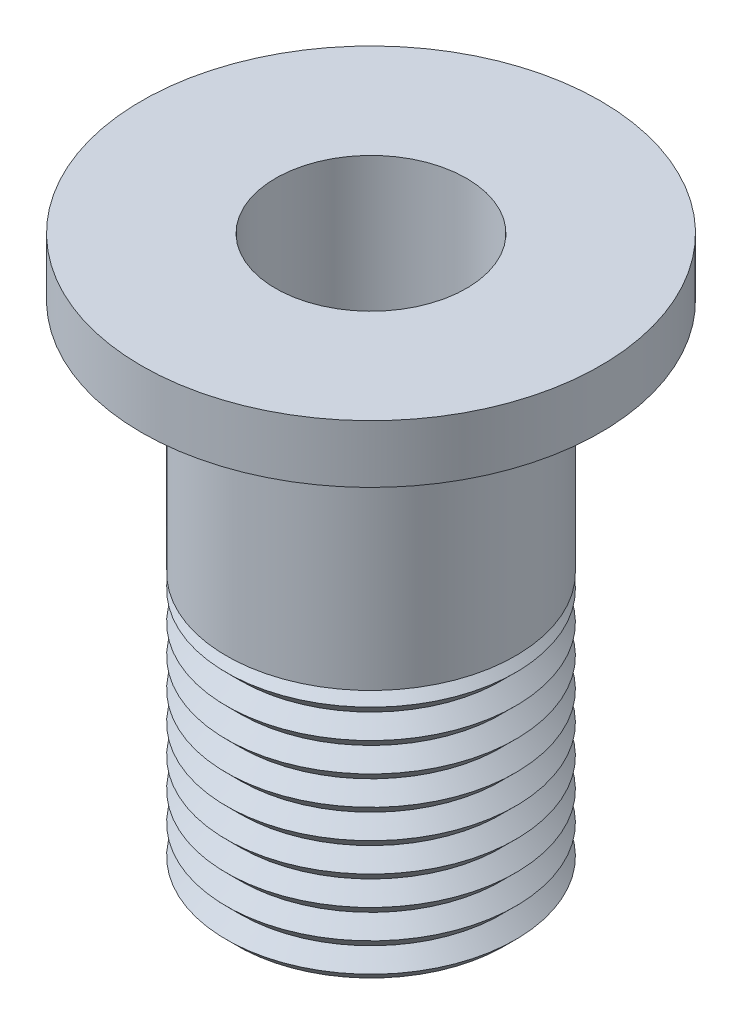
ISO-10303-21;
HEADER;
FILE_DESCRIPTION(('STEP AP214'),'2;1');
FILE_NAME('part.step','',(''),(''),'','','');
FILE_SCHEMA(('AUTOMOTIVE_DESIGN { 1 0 10303 214 1 1 1 1 }'));
ENDSEC;
DATA;
#1=APPLICATION_CONTEXT('core data for automotive mechanical design processes');
#2=APPLICATION_PROTOCOL_DEFINITION('international standard','automotive_design',2000,#1);
#3=PRODUCT_CONTEXT('',#1,'mechanical');
#4=PRODUCT('Part','Part','',(#3));
#5=PRODUCT_RELATED_PRODUCT_CATEGORY('part','',(#4));
#6=PRODUCT_DEFINITION_FORMATION('','',#4);
#7=PRODUCT_DEFINITION_CONTEXT('part definition',#1,'design');
#8=PRODUCT_DEFINITION('design','',#6,#7);
#9=PRODUCT_DEFINITION_SHAPE('','',#8);
#10=(LENGTH_UNIT() NAMED_UNIT(*) SI_UNIT(.MILLI.,.METRE.));
#11=(NAMED_UNIT(*) PLANE_ANGLE_UNIT() SI_UNIT($,.RADIAN.));
#12=(NAMED_UNIT(*) SI_UNIT($,.STERADIAN.) SOLID_ANGLE_UNIT());
#13=UNCERTAINTY_MEASURE_WITH_UNIT(LENGTH_MEASURE(1.E-05),#10,'distance_accuracy_value','');
#14=(GEOMETRIC_REPRESENTATION_CONTEXT(3) GLOBAL_UNCERTAINTY_ASSIGNED_CONTEXT((#13)) GLOBAL_UNIT_ASSIGNED_CONTEXT((#10,
#11,#12)) REPRESENTATION_CONTEXT('',''));
#15=CARTESIAN_POINT('',(0.,0.,0.));
#16=DIRECTION('',(0.,0.,1.));
#17=DIRECTION('',(1.,0.,0.));
#18=AXIS2_PLACEMENT_3D('',#15,#16,#17);
#19=CARTESIAN_POINT('',(4.61000000000001,0.,0.));
#20=DIRECTION('',(0.,-1.,0.));
#21=DIRECTION('',(0.,0.,-1.));
#22=AXIS2_PLACEMENT_3D('',#19,#20,#21);
#23=PLANE('',#22);
#24=CARTESIAN_POINT('',(0.,0.,0.));
#25=DIRECTION('',(0.,-1.,0.));
#26=DIRECTION('',(0.,0.,-1.));
#27=AXIS2_PLACEMENT_3D('',#24,#25,#26);
#28=CIRCLE('',#27,4.61000000000001);
#29=CARTESIAN_POINT('',(0.,0.,-4.61000000000001));
#30=VERTEX_POINT('',#29);
#31=EDGE_CURVE('E109',#30,#30,#28,.T.);
#32=ORIENTED_EDGE('',*,*,#31,.T.);
#33=EDGE_LOOP('',(#32));
#34=FACE_BOUND('',#33,.T.);
#35=CARTESIAN_POINT('',(0.,0.,0.));
#36=DIRECTION('',(0.,-1.,0.));
#37=DIRECTION('',(0.,0.,-1.));
#38=AXIS2_PLACEMENT_3D('',#35,#36,#37);
#39=CIRCLE('',#38,3.302);
#40=CARTESIAN_POINT('',(0.,0.,-3.302));
#41=VERTEX_POINT('',#40);
#42=EDGE_CURVE('E10',#41,#41,#39,.T.);
#43=ORIENTED_EDGE('',*,*,#42,.F.);
#44=EDGE_LOOP('',(#43));
#45=FACE_BOUND('',#44,.T.);
#46=ADVANCED_FACE('F30',(#34,#45),#23,.T.);
#47=CARTESIAN_POINT('',(0.,0.,0.));
#48=DIRECTION('',(0.,-1.,0.));
#49=DIRECTION('',(0.,0.,-1.));
#50=AXIS2_PLACEMENT_3D('',#47,#48,#49);
#51=CYLINDRICAL_SURFACE('',#50,3.302);
#52=ORIENTED_EDGE('',*,*,#42,.T.);
#53=EDGE_LOOP('',(#52));
#54=FACE_BOUND('',#53,.T.);
#55=CARTESIAN_POINT('',(0.,19.05,0.));
#56=DIRECTION('',(0.,-1.,0.));
#57=DIRECTION('',(0.,0.,-1.));
#58=AXIS2_PLACEMENT_3D('',#55,#56,#57);
#59=CIRCLE('',#58,3.302);
#60=CARTESIAN_POINT('',(0.,19.05,-3.302));
#61=VERTEX_POINT('',#60);
#62=EDGE_CURVE('E36',#61,#61,#59,.T.);
#63=ORIENTED_EDGE('',*,*,#62,.F.);
#64=EDGE_LOOP('',(#63));
#65=FACE_BOUND('',#64,.T.);
#66=ADVANCED_FACE('F127',(#54,#65),#51,.F.);
#67=CARTESIAN_POINT('',(3.302,19.05,0.));
#68=DIRECTION('',(0.,1.,0.));
#69=DIRECTION('',(0.,0.,1.));
#70=AXIS2_PLACEMENT_3D('',#67,#68,#69);
#71=PLANE('',#70);
#72=ORIENTED_EDGE('',*,*,#62,.T.);
#73=EDGE_LOOP('',(#72));
#74=FACE_BOUND('',#73,.T.);
#75=CARTESIAN_POINT('',(0.,19.05,0.));
#76=DIRECTION('',(0.,-1.,0.));
#77=DIRECTION('',(0.,0.,-1.));
#78=AXIS2_PLACEMENT_3D('',#75,#76,#77);
#79=CIRCLE('',#78,7.9375);
#80=CARTESIAN_POINT('',(0.,19.05,-7.9375));
#81=VERTEX_POINT('',#80);
#82=EDGE_CURVE('E40',#81,#81,#79,.T.);
#83=ORIENTED_EDGE('',*,*,#82,.F.);
#84=EDGE_LOOP('',(#83));
#85=FACE_BOUND('',#84,.T.);
#86=ADVANCED_FACE('F131',(#74,#85),#71,.T.);
#87=CARTESIAN_POINT('',(0.,0.,0.));
#88=DIRECTION('',(0.,-1.,0.));
#89=DIRECTION('',(0.,0.,-1.));
#90=AXIS2_PLACEMENT_3D('',#87,#88,#89);
#91=CYLINDRICAL_SURFACE('',#90,7.9375);
#92=ORIENTED_EDGE('',*,*,#82,.T.);
#93=EDGE_LOOP('',(#92));
#94=FACE_BOUND('',#93,.T.);
#95=CARTESIAN_POINT('',(0.,17.05,0.));
#96=DIRECTION('',(0.,-1.,0.));
#97=DIRECTION('',(0.,0.,-1.));
#98=AXIS2_PLACEMENT_3D('',#95,#96,#97);
#99=CIRCLE('',#98,7.9375);
#100=CARTESIAN_POINT('',(0.,17.05,-7.9375));
#101=VERTEX_POINT('',#100);
#102=EDGE_CURVE('E44',#101,#101,#99,.T.);
#103=ORIENTED_EDGE('',*,*,#102,.F.);
#104=EDGE_LOOP('',(#103));
#105=FACE_BOUND('',#104,.T.);
#106=ADVANCED_FACE('F135',(#94,#105),#91,.T.);
#107=CARTESIAN_POINT('',(7.9375,17.05,0.));
#108=DIRECTION('',(0.,-1.,0.));
#109=DIRECTION('',(0.,0.,-1.));
#110=AXIS2_PLACEMENT_3D('',#107,#108,#109);
#111=PLANE('',#110);
#112=ORIENTED_EDGE('',*,*,#102,.T.);
#113=EDGE_LOOP('',(#112));
#114=FACE_BOUND('',#113,.T.);
#115=CARTESIAN_POINT('',(0.,17.05,0.));
#116=DIRECTION('',(0.,-1.,0.));
#117=DIRECTION('',(0.,0.,-1.));
#118=AXIS2_PLACEMENT_3D('',#115,#116,#117);
#119=CIRCLE('',#118,5.);
#120=CARTESIAN_POINT('',(0.,17.05,-5.));
#121=VERTEX_POINT('',#120);
#122=EDGE_CURVE('E49',#121,#121,#119,.T.);
#123=ORIENTED_EDGE('',*,*,#122,.F.);
#124=EDGE_LOOP('',(#123));
#125=FACE_BOUND('',#124,.T.);
#126=ADVANCED_FACE('F141',(#114,#125),#111,.T.);
#127=CARTESIAN_POINT('',(0.,0.,0.));
#128=DIRECTION('',(0.,-1.,0.));
#129=DIRECTION('',(0.,0.,-1.));
#130=AXIS2_PLACEMENT_3D('',#127,#128,#129);
#131=CYLINDRICAL_SURFACE('',#130,5.);
#132=ORIENTED_EDGE('',*,*,#122,.T.);
#133=EDGE_LOOP('',(#132));
#134=FACE_BOUND('',#133,.T.);
#135=CARTESIAN_POINT('',(0.,8.89,0.));
#136=DIRECTION('',(0.,-1.,0.));
#137=DIRECTION('',(0.,0.,-1.));
#138=AXIS2_PLACEMENT_3D('',#135,#136,#137);
#139=CIRCLE('',#138,5.);
#140=CARTESIAN_POINT('',(0.,8.89,-5.));
#141=VERTEX_POINT('',#140);
#142=EDGE_CURVE('E52',#141,#141,#139,.T.);
#143=ORIENTED_EDGE('',*,*,#142,.F.);
#144=EDGE_LOOP('',(#143));
#145=FACE_BOUND('',#144,.T.);
#146=ADVANCED_FACE('F145',(#134,#145),#131,.T.);
#147=CARTESIAN_POINT('',(5.,8.89,0.));
#148=DIRECTION('',(0.,-1.,0.));
#149=DIRECTION('',(0.,0.,-1.));
#150=AXIS2_PLACEMENT_3D('',#147,#148,#149);
#151=PLANE('',#150);
#152=ORIENTED_EDGE('',*,*,#142,.T.);
#153=EDGE_LOOP('',(#152));
#154=FACE_BOUND('',#153,.T.);
#155=CARTESIAN_POINT('',(0.,8.89,0.));
#156=DIRECTION('',(0.,-1.,0.));
#157=DIRECTION('',(0.,0.,-1.));
#158=AXIS2_PLACEMENT_3D('',#155,#156,#157);
#159=CIRCLE('',#158,4.5);
#160=CARTESIAN_POINT('',(0.,8.89,-4.5));
#161=VERTEX_POINT('',#160);
#162=EDGE_CURVE('E55',#161,#161,#159,.T.);
#163=ORIENTED_EDGE('',*,*,#162,.F.);
#164=EDGE_LOOP('',(#163));
#165=FACE_BOUND('',#164,.T.);
#166=ADVANCED_FACE('F149',(#154,#165),#151,.T.);
#167=CARTESIAN_POINT('',(0.,8.39,0.));
#168=DIRECTION('',(0.,-1.,0.));
#169=DIRECTION('',(0.,0.,-1.));
#170=AXIS2_PLACEMENT_3D('',#167,#168,#169);
#171=CONICAL_SURFACE('',#170,5.,0.785398163397449);
#172=ORIENTED_EDGE('',*,*,#162,.T.);
#173=EDGE_LOOP('',(#172));
#174=FACE_BOUND('',#173,.T.);
#175=CARTESIAN_POINT('',(0.,8.39,0.));
#176=DIRECTION('',(0.,-1.,0.));
#177=DIRECTION('',(0.,0.,-1.));
#178=AXIS2_PLACEMENT_3D('',#175,#176,#177);
#179=CIRCLE('',#178,5.);
#180=CARTESIAN_POINT('',(0.,8.39,-5.));
#181=VERTEX_POINT('',#180);
#182=EDGE_CURVE('E58',#181,#181,#179,.T.);
#183=ORIENTED_EDGE('',*,*,#182,.F.);
#184=EDGE_LOOP('',(#183));
#185=FACE_BOUND('',#184,.T.);
#186=ADVANCED_FACE('F153',(#174,#185),#171,.T.);
#187=CARTESIAN_POINT('',(0.,7.89,0.));
#188=DIRECTION('',(0.,1.,0.));
#189=DIRECTION('',(0.,0.,1.));
#190=AXIS2_PLACEMENT_3D('',#187,#188,#189);
#191=CONICAL_SURFACE('',#190,4.5,0.785398163397449);
#192=ORIENTED_EDGE('',*,*,#182,.T.);
#193=EDGE_LOOP('',(#192));
#194=FACE_BOUND('',#193,.T.);
#195=CARTESIAN_POINT('',(0.,7.89,0.));
#196=DIRECTION('',(0.,-1.,0.));
#197=DIRECTION('',(0.,0.,-1.));
#198=AXIS2_PLACEMENT_3D('',#195,#196,#197);
#199=CIRCLE('',#198,4.5);
#200=CARTESIAN_POINT('',(0.,7.89,-4.5));
#201=VERTEX_POINT('',#200);
#202=EDGE_CURVE('E61',#201,#201,#199,.T.);
#203=ORIENTED_EDGE('',*,*,#202,.F.);
#204=EDGE_LOOP('',(#203));
#205=FACE_BOUND('',#204,.T.);
#206=ADVANCED_FACE('F157',(#194,#205),#191,.T.);
#207=CARTESIAN_POINT('',(0.,7.39,0.));
#208=DIRECTION('',(0.,-1.,0.));
#209=DIRECTION('',(0.,0.,-1.));
#210=AXIS2_PLACEMENT_3D('',#207,#208,#209);
#211=CONICAL_SURFACE('',#210,5.,0.785398163397448);
#212=ORIENTED_EDGE('',*,*,#202,.T.);
#213=EDGE_LOOP('',(#212));
#214=FACE_BOUND('',#213,.T.);
#215=CARTESIAN_POINT('',(0.,7.39,0.));
#216=DIRECTION('',(0.,-1.,0.));
#217=DIRECTION('',(0.,0.,-1.));
#218=AXIS2_PLACEMENT_3D('',#215,#216,#217);
#219=CIRCLE('',#218,5.);
#220=CARTESIAN_POINT('',(0.,7.39,-5.));
#221=VERTEX_POINT('',#220);
#222=EDGE_CURVE('E64',#221,#221,#219,.T.);
#223=ORIENTED_EDGE('',*,*,#222,.F.);
#224=EDGE_LOOP('',(#223));
#225=FACE_BOUND('',#224,.T.);
#226=ADVANCED_FACE('F161',(#214,#225),#211,.T.);
#227=CARTESIAN_POINT('',(0.,6.89,0.));
#228=DIRECTION('',(0.,1.,0.));
#229=DIRECTION('',(0.,0.,1.));
#230=AXIS2_PLACEMENT_3D('',#227,#228,#229);
#231=CONICAL_SURFACE('',#230,4.5,0.785398163397451);
#232=ORIENTED_EDGE('',*,*,#222,.T.);
#233=EDGE_LOOP('',(#232));
#234=FACE_BOUND('',#233,.T.);
#235=CARTESIAN_POINT('',(0.,6.89,0.));
#236=DIRECTION('',(0.,-1.,0.));
#237=DIRECTION('',(0.,0.,-1.));
#238=AXIS2_PLACEMENT_3D('',#235,#236,#237);
#239=CIRCLE('',#238,4.5);
#240=CARTESIAN_POINT('',(0.,6.89,-4.5));
#241=VERTEX_POINT('',#240);
#242=EDGE_CURVE('E67',#241,#241,#239,.T.);
#243=ORIENTED_EDGE('',*,*,#242,.F.);
#244=EDGE_LOOP('',(#243));
#245=FACE_BOUND('',#244,.T.);
#246=ADVANCED_FACE('F165',(#234,#245),#231,.T.);
#247=CARTESIAN_POINT('',(0.,6.39,0.));
#248=DIRECTION('',(0.,-1.,0.));
#249=DIRECTION('',(0.,0.,-1.));
#250=AXIS2_PLACEMENT_3D('',#247,#248,#249);
#251=CONICAL_SURFACE('',#250,5.,0.785398163397449);
#252=ORIENTED_EDGE('',*,*,#242,.T.);
#253=EDGE_LOOP('',(#252));
#254=FACE_BOUND('',#253,.T.);
#255=CARTESIAN_POINT('',(0.,6.39,0.));
#256=DIRECTION('',(0.,-1.,0.));
#257=DIRECTION('',(0.,0.,-1.));
#258=AXIS2_PLACEMENT_3D('',#255,#256,#257);
#259=CIRCLE('',#258,5.);
#260=CARTESIAN_POINT('',(0.,6.39,-5.));
#261=VERTEX_POINT('',#260);
#262=EDGE_CURVE('E70',#261,#261,#259,.T.);
#263=ORIENTED_EDGE('',*,*,#262,.F.);
#264=EDGE_LOOP('',(#263));
#265=FACE_BOUND('',#264,.T.);
#266=ADVANCED_FACE('F169',(#254,#265),#251,.T.);
#267=CARTESIAN_POINT('',(0.,5.89,0.));
#268=DIRECTION('',(0.,1.,0.));
#269=DIRECTION('',(0.,0.,1.));
#270=AXIS2_PLACEMENT_3D('',#267,#268,#269);
#271=CONICAL_SURFACE('',#270,4.5,0.785398163397452);
#272=ORIENTED_EDGE('',*,*,#262,.T.);
#273=EDGE_LOOP('',(#272));
#274=FACE_BOUND('',#273,.T.);
#275=CARTESIAN_POINT('',(0.,5.89,0.));
#276=DIRECTION('',(0.,-1.,0.));
#277=DIRECTION('',(0.,0.,-1.));
#278=AXIS2_PLACEMENT_3D('',#275,#276,#277);
#279=CIRCLE('',#278,4.5);
#280=CARTESIAN_POINT('',(0.,5.89,-4.5));
#281=VERTEX_POINT('',#280);
#282=EDGE_CURVE('E73',#281,#281,#279,.T.);
#283=ORIENTED_EDGE('',*,*,#282,.F.);
#284=EDGE_LOOP('',(#283));
#285=FACE_BOUND('',#284,.T.);
#286=ADVANCED_FACE('F173',(#274,#285),#271,.T.);
#287=CARTESIAN_POINT('',(0.,5.39,0.));
#288=DIRECTION('',(0.,-1.,0.));
#289=DIRECTION('',(0.,0.,-1.));
#290=AXIS2_PLACEMENT_3D('',#287,#288,#289);
#291=CONICAL_SURFACE('',#290,5.,0.785398163397449);
#292=ORIENTED_EDGE('',*,*,#282,.T.);
#293=EDGE_LOOP('',(#292));
#294=FACE_BOUND('',#293,.T.);
#295=CARTESIAN_POINT('',(0.,5.39,0.));
#296=DIRECTION('',(0.,-1.,0.));
#297=DIRECTION('',(0.,0.,-1.));
#298=AXIS2_PLACEMENT_3D('',#295,#296,#297);
#299=CIRCLE('',#298,5.);
#300=CARTESIAN_POINT('',(0.,5.39,-5.));
#301=VERTEX_POINT('',#300);
#302=EDGE_CURVE('E76',#301,#301,#299,.T.);
#303=ORIENTED_EDGE('',*,*,#302,.F.);
#304=EDGE_LOOP('',(#303));
#305=FACE_BOUND('',#304,.T.);
#306=ADVANCED_FACE('F177',(#294,#305),#291,.T.);
#307=CARTESIAN_POINT('',(0.,4.89,0.));
#308=DIRECTION('',(0.,1.,0.));
#309=DIRECTION('',(0.,0.,1.));
#310=AXIS2_PLACEMENT_3D('',#307,#308,#309);
#311=CONICAL_SURFACE('',#310,4.5,0.78539816339745);
#312=ORIENTED_EDGE('',*,*,#302,.T.);
#313=EDGE_LOOP('',(#312));
#314=FACE_BOUND('',#313,.T.);
#315=CARTESIAN_POINT('',(0.,4.89,0.));
#316=DIRECTION('',(0.,-1.,0.));
#317=DIRECTION('',(0.,0.,-1.));
#318=AXIS2_PLACEMENT_3D('',#315,#316,#317);
#319=CIRCLE('',#318,4.5);
#320=CARTESIAN_POINT('',(0.,4.89,-4.5));
#321=VERTEX_POINT('',#320);
#322=EDGE_CURVE('E79',#321,#321,#319,.T.);
#323=ORIENTED_EDGE('',*,*,#322,.F.);
#324=EDGE_LOOP('',(#323));
#325=FACE_BOUND('',#324,.T.);
#326=ADVANCED_FACE('F181',(#314,#325),#311,.T.);
#327=CARTESIAN_POINT('',(0.,4.39,0.));
#328=DIRECTION('',(0.,-1.,0.));
#329=DIRECTION('',(0.,0.,-1.));
#330=AXIS2_PLACEMENT_3D('',#327,#328,#329);
#331=CONICAL_SURFACE('',#330,5.,0.785398163397448);
#332=ORIENTED_EDGE('',*,*,#322,.T.);
#333=EDGE_LOOP('',(#332));
#334=FACE_BOUND('',#333,.T.);
#335=CARTESIAN_POINT('',(0.,4.39,0.));
#336=DIRECTION('',(0.,-1.,0.));
#337=DIRECTION('',(0.,0.,-1.));
#338=AXIS2_PLACEMENT_3D('',#335,#336,#337);
#339=CIRCLE('',#338,5.);
#340=CARTESIAN_POINT('',(0.,4.39,-5.));
#341=VERTEX_POINT('',#340);
#342=EDGE_CURVE('E82',#341,#341,#339,.T.);
#343=ORIENTED_EDGE('',*,*,#342,.F.);
#344=EDGE_LOOP('',(#343));
#345=FACE_BOUND('',#344,.T.);
#346=ADVANCED_FACE('F185',(#334,#345),#331,.T.);
#347=CARTESIAN_POINT('',(0.,3.89,0.));
#348=DIRECTION('',(0.,1.,0.));
#349=DIRECTION('',(0.,0.,1.));
#350=AXIS2_PLACEMENT_3D('',#347,#348,#349);
#351=CONICAL_SURFACE('',#350,4.5,0.785398163397449);
#352=ORIENTED_EDGE('',*,*,#342,.T.);
#353=EDGE_LOOP('',(#352));
#354=FACE_BOUND('',#353,.T.);
#355=CARTESIAN_POINT('',(0.,3.89,0.));
#356=DIRECTION('',(0.,-1.,0.));
#357=DIRECTION('',(0.,0.,-1.));
#358=AXIS2_PLACEMENT_3D('',#355,#356,#357);
#359=CIRCLE('',#358,4.5);
#360=CARTESIAN_POINT('',(0.,3.89,-4.5));
#361=VERTEX_POINT('',#360);
#362=EDGE_CURVE('E85',#361,#361,#359,.T.);
#363=ORIENTED_EDGE('',*,*,#362,.F.);
#364=EDGE_LOOP('',(#363));
#365=FACE_BOUND('',#364,.T.);
#366=ADVANCED_FACE('F189',(#354,#365),#351,.T.);
#367=CARTESIAN_POINT('',(0.,3.39,0.));
#368=DIRECTION('',(0.,-1.,0.));
#369=DIRECTION('',(0.,0.,-1.));
#370=AXIS2_PLACEMENT_3D('',#367,#368,#369);
#371=CONICAL_SURFACE('',#370,5.,0.785398163397448);
#372=ORIENTED_EDGE('',*,*,#362,.T.);
#373=EDGE_LOOP('',(#372));
#374=FACE_BOUND('',#373,.T.);
#375=CARTESIAN_POINT('',(0.,3.39,0.));
#376=DIRECTION('',(0.,-1.,0.));
#377=DIRECTION('',(0.,0.,-1.));
#378=AXIS2_PLACEMENT_3D('',#375,#376,#377);
#379=CIRCLE('',#378,5.);
#380=CARTESIAN_POINT('',(0.,3.39,-5.));
#381=VERTEX_POINT('',#380);
#382=EDGE_CURVE('E88',#381,#381,#379,.T.);
#383=ORIENTED_EDGE('',*,*,#382,.F.);
#384=EDGE_LOOP('',(#383));
#385=FACE_BOUND('',#384,.T.);
#386=ADVANCED_FACE('F193',(#374,#385),#371,.T.);
#387=CARTESIAN_POINT('',(0.,2.89,0.));
#388=DIRECTION('',(0.,1.,0.));
#389=DIRECTION('',(0.,0.,1.));
#390=AXIS2_PLACEMENT_3D('',#387,#388,#389);
#391=CONICAL_SURFACE('',#390,4.5,0.785398163397451);
#392=ORIENTED_EDGE('',*,*,#382,.T.);
#393=EDGE_LOOP('',(#392));
#394=FACE_BOUND('',#393,.T.);
#395=CARTESIAN_POINT('',(0.,2.89,0.));
#396=DIRECTION('',(0.,-1.,0.));
#397=DIRECTION('',(0.,0.,-1.));
#398=AXIS2_PLACEMENT_3D('',#395,#396,#397);
#399=CIRCLE('',#398,4.5);
#400=CARTESIAN_POINT('',(0.,2.89,-4.5));
#401=VERTEX_POINT('',#400);
#402=EDGE_CURVE('E91',#401,#401,#399,.T.);
#403=ORIENTED_EDGE('',*,*,#402,.F.);
#404=EDGE_LOOP('',(#403));
#405=FACE_BOUND('',#404,.T.);
#406=ADVANCED_FACE('F197',(#394,#405),#391,.T.);
#407=CARTESIAN_POINT('',(0.,2.39,0.));
#408=DIRECTION('',(0.,-1.,0.));
#409=DIRECTION('',(0.,0.,-1.));
#410=AXIS2_PLACEMENT_3D('',#407,#408,#409);
#411=CONICAL_SURFACE('',#410,5.,0.78539816339745);
#412=ORIENTED_EDGE('',*,*,#402,.T.);
#413=EDGE_LOOP('',(#412));
#414=FACE_BOUND('',#413,.T.);
#415=CARTESIAN_POINT('',(0.,2.39,0.));
#416=DIRECTION('',(0.,-1.,0.));
#417=DIRECTION('',(0.,0.,-1.));
#418=AXIS2_PLACEMENT_3D('',#415,#416,#417);
#419=CIRCLE('',#418,5.);
#420=CARTESIAN_POINT('',(0.,2.39,-5.));
#421=VERTEX_POINT('',#420);
#422=EDGE_CURVE('E94',#421,#421,#419,.T.);
#423=ORIENTED_EDGE('',*,*,#422,.F.);
#424=EDGE_LOOP('',(#423));
#425=FACE_BOUND('',#424,.T.);
#426=ADVANCED_FACE('F201',(#414,#425),#411,.T.);
#427=CARTESIAN_POINT('',(0.,1.89,0.));
#428=DIRECTION('',(0.,1.,0.));
#429=DIRECTION('',(0.,0.,1.));
#430=AXIS2_PLACEMENT_3D('',#427,#428,#429);
#431=CONICAL_SURFACE('',#430,4.5,0.785398163397449);
#432=ORIENTED_EDGE('',*,*,#422,.T.);
#433=EDGE_LOOP('',(#432));
#434=FACE_BOUND('',#433,.T.);
#435=CARTESIAN_POINT('',(0.,1.89,0.));
#436=DIRECTION('',(0.,-1.,0.));
#437=DIRECTION('',(0.,0.,-1.));
#438=AXIS2_PLACEMENT_3D('',#435,#436,#437);
#439=CIRCLE('',#438,4.5);
#440=CARTESIAN_POINT('',(0.,1.89,-4.5));
#441=VERTEX_POINT('',#440);
#442=EDGE_CURVE('E97',#441,#441,#439,.T.);
#443=ORIENTED_EDGE('',*,*,#442,.F.);
#444=EDGE_LOOP('',(#443));
#445=FACE_BOUND('',#444,.T.);
#446=ADVANCED_FACE('F205',(#434,#445),#431,.T.);
#447=CARTESIAN_POINT('',(0.,1.39,0.));
#448=DIRECTION('',(0.,-1.,0.));
#449=DIRECTION('',(0.,0.,-1.));
#450=AXIS2_PLACEMENT_3D('',#447,#448,#449);
#451=CONICAL_SURFACE('',#450,5.,0.785398163397449);
#452=ORIENTED_EDGE('',*,*,#442,.T.);
#453=EDGE_LOOP('',(#452));
#454=FACE_BOUND('',#453,.T.);
#455=CARTESIAN_POINT('',(0.,1.39,0.));
#456=DIRECTION('',(0.,-1.,0.));
#457=DIRECTION('',(0.,0.,-1.));
#458=AXIS2_PLACEMENT_3D('',#455,#456,#457);
#459=CIRCLE('',#458,5.);
#460=CARTESIAN_POINT('',(0.,1.39,-5.));
#461=VERTEX_POINT('',#460);
#462=EDGE_CURVE('E100',#461,#461,#459,.T.);
#463=ORIENTED_EDGE('',*,*,#462,.F.);
#464=EDGE_LOOP('',(#463));
#465=FACE_BOUND('',#464,.T.);
#466=ADVANCED_FACE('F209',(#454,#465),#451,.T.);
#467=CARTESIAN_POINT('',(0.,0.889999999999995,0.));
#468=DIRECTION('',(0.,1.,0.));
#469=DIRECTION('',(0.,0.,1.));
#470=AXIS2_PLACEMENT_3D('',#467,#468,#469);
#471=CONICAL_SURFACE('',#470,4.5,0.785398163397448);
#472=ORIENTED_EDGE('',*,*,#462,.T.);
#473=EDGE_LOOP('',(#472));
#474=FACE_BOUND('',#473,.T.);
#475=CARTESIAN_POINT('',(0.,0.889999999999995,0.));
#476=DIRECTION('',(0.,-1.,0.));
#477=DIRECTION('',(0.,0.,-1.));
#478=AXIS2_PLACEMENT_3D('',#475,#476,#477);
#479=CIRCLE('',#478,4.5);
#480=CARTESIAN_POINT('',(0.,0.889999999999995,-4.5));
#481=VERTEX_POINT('',#480);
#482=EDGE_CURVE('E103',#481,#481,#479,.T.);
#483=ORIENTED_EDGE('',*,*,#482,.F.);
#484=EDGE_LOOP('',(#483));
#485=FACE_BOUND('',#484,.T.);
#486=ADVANCED_FACE('F123',(#474,#485),#471,.T.);
#487=CARTESIAN_POINT('',(0.,0.389999999999995,0.));
#488=DIRECTION('',(0.,-1.,0.));
#489=DIRECTION('',(0.,0.,-1.));
#490=AXIS2_PLACEMENT_3D('',#487,#488,#489);
#491=CONICAL_SURFACE('',#490,5.,0.785398163397449);
#492=ORIENTED_EDGE('',*,*,#482,.T.);
#493=EDGE_LOOP('',(#492));
#494=FACE_BOUND('',#493,.T.);
#495=CARTESIAN_POINT('',(0.,0.389999999999995,0.));
#496=DIRECTION('',(0.,-1.,0.));
#497=DIRECTION('',(0.,0.,-1.));
#498=AXIS2_PLACEMENT_3D('',#495,#496,#497);
#499=CIRCLE('',#498,5.);
#500=CARTESIAN_POINT('',(0.,0.389999999999995,-5.));
#501=VERTEX_POINT('',#500);
#502=EDGE_CURVE('E106',#501,#501,#499,.T.);
#503=ORIENTED_EDGE('',*,*,#502,.F.);
#504=EDGE_LOOP('',(#503));
#505=FACE_BOUND('',#504,.T.);
#506=ADVANCED_FACE('F117',(#494,#505),#491,.T.);
#507=CARTESIAN_POINT('',(0.,0.,0.));
#508=DIRECTION('',(0.,1.,0.));
#509=DIRECTION('',(0.,0.,1.));
#510=AXIS2_PLACEMENT_3D('',#507,#508,#509);
#511=CONICAL_SURFACE('',#510,4.61000000000001,0.785398163397449);
#512=ORIENTED_EDGE('',*,*,#502,.T.);
#513=EDGE_LOOP('',(#512));
#514=FACE_BOUND('',#513,.T.);
#515=ORIENTED_EDGE('',*,*,#31,.F.);
#516=EDGE_LOOP('',(#515));
#517=FACE_BOUND('',#516,.T.);
#518=ADVANCED_FACE('F115',(#514,#517),#511,.T.);
#519=CLOSED_SHELL('',(#46,#66,#86,#106,#126,#146,#166,#186,#206,#226,#246,#266,#286,#306,#326,
#346,#366,#386,#406,#426,#446,#466,#486,#506,#518));
#520=MANIFOLD_SOLID_BREP('B2',#519);
#521=ADVANCED_BREP_SHAPE_REPRESENTATION('',(#18,#520),#14);
#522=SHAPE_DEFINITION_REPRESENTATION(#9,#521);
ENDSEC;
END-ISO-10303-21;
